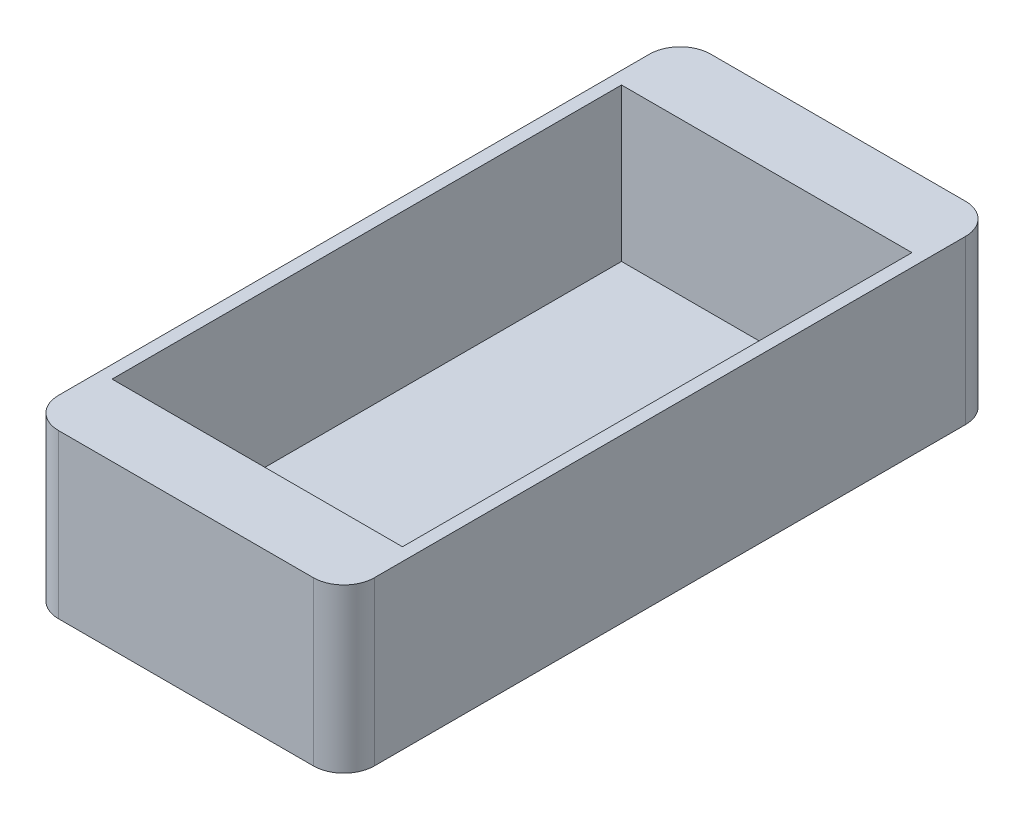
ISO-10303-21;
HEADER;
FILE_DESCRIPTION(('STEP AP214'),'2;1');
FILE_NAME('part.step','',(''),(''),'','','');
FILE_SCHEMA(('AUTOMOTIVE_DESIGN { 1 0 10303 214 1 1 1 1 }'));
ENDSEC;
DATA;
#1=APPLICATION_CONTEXT('core data for automotive mechanical design processes');
#2=APPLICATION_PROTOCOL_DEFINITION('international standard','automotive_design',2000,#1);
#3=PRODUCT_CONTEXT('',#1,'mechanical');
#4=PRODUCT('Part','Part','',(#3));
#5=PRODUCT_RELATED_PRODUCT_CATEGORY('part','',(#4));
#6=PRODUCT_DEFINITION_FORMATION('','',#4);
#7=PRODUCT_DEFINITION_CONTEXT('part definition',#1,'design');
#8=PRODUCT_DEFINITION('design','',#6,#7);
#9=PRODUCT_DEFINITION_SHAPE('','',#8);
#10=(LENGTH_UNIT() NAMED_UNIT(*) SI_UNIT(.MILLI.,.METRE.));
#11=(NAMED_UNIT(*) PLANE_ANGLE_UNIT() SI_UNIT($,.RADIAN.));
#12=(NAMED_UNIT(*) SI_UNIT($,.STERADIAN.) SOLID_ANGLE_UNIT());
#13=UNCERTAINTY_MEASURE_WITH_UNIT(LENGTH_MEASURE(1.E-05),#10,'distance_accuracy_value','');
#14=(GEOMETRIC_REPRESENTATION_CONTEXT(3) GLOBAL_UNCERTAINTY_ASSIGNED_CONTEXT((#13)) GLOBAL_UNIT_ASSIGNED_CONTEXT((#10,
#11,#12)) REPRESENTATION_CONTEXT('',''));
#15=CARTESIAN_POINT('',(0.,0.,0.));
#16=DIRECTION('',(0.,0.,1.));
#17=DIRECTION('',(1.,0.,0.));
#18=AXIS2_PLACEMENT_3D('',#15,#16,#17);
#19=CARTESIAN_POINT('',(0.,15.,0.));
#20=DIRECTION('',(0.,1.,0.));
#21=DIRECTION('',(0.,0.,1.));
#22=AXIS2_PLACEMENT_3D('',#19,#20,#21);
#23=PLANE('',#22);
#24=DIRECTION('',(1.,0.,0.));
#25=VECTOR('',#24,1.);
#26=CARTESIAN_POINT('',(-15.5,15.,32.));
#27=LINE('',#26,#25);
#28=CARTESIAN_POINT('',(-12.5,15.,32.));
#29=VERTEX_POINT('',#28);
#30=CARTESIAN_POINT('',(12.5,15.,32.));
#31=VERTEX_POINT('',#30);
#32=EDGE_CURVE('E170',#29,#31,#27,.T.);
#33=ORIENTED_EDGE('',*,*,#32,.T.);
#34=CARTESIAN_POINT('',(12.5,15.,29.));
#35=DIRECTION('',(0.,1.,0.));
#36=DIRECTION('',(0.,0.,1.));
#37=AXIS2_PLACEMENT_3D('',#34,#35,#36);
#38=CIRCLE('',#37,3.);
#39=CARTESIAN_POINT('',(15.5,15.,29.));
#40=VERTEX_POINT('',#39);
#41=EDGE_CURVE('E196',#31,#40,#38,.T.);
#42=ORIENTED_EDGE('',*,*,#41,.T.);
#43=DIRECTION('',(0.,0.,-1.));
#44=VECTOR('',#43,1.);
#45=CARTESIAN_POINT('',(15.5,15.,-32.));
#46=LINE('',#45,#44);
#47=CARTESIAN_POINT('',(15.5,15.,-29.));
#48=VERTEX_POINT('',#47);
#49=EDGE_CURVE('E163',#40,#48,#46,.T.);
#50=ORIENTED_EDGE('',*,*,#49,.T.);
#51=CARTESIAN_POINT('',(12.5,15.,-29.));
#52=DIRECTION('',(0.,1.,0.));
#53=DIRECTION('',(0.,0.,1.));
#54=AXIS2_PLACEMENT_3D('',#51,#52,#53);
#55=CIRCLE('',#54,3.);
#56=CARTESIAN_POINT('',(12.5,15.,-32.));
#57=VERTEX_POINT('',#56);
#58=EDGE_CURVE('E192',#48,#57,#55,.T.);
#59=ORIENTED_EDGE('',*,*,#58,.T.);
#60=DIRECTION('',(-1.,0.,0.));
#61=VECTOR('',#60,1.);
#62=CARTESIAN_POINT('',(-15.5,15.,-32.));
#63=LINE('',#62,#61);
#64=CARTESIAN_POINT('',(-12.5,15.,-32.));
#65=VERTEX_POINT('',#64);
#66=EDGE_CURVE('E166',#57,#65,#63,.T.);
#67=ORIENTED_EDGE('',*,*,#66,.T.);
#68=CARTESIAN_POINT('',(-12.5,15.,-29.));
#69=DIRECTION('',(0.,1.,0.));
#70=DIRECTION('',(0.,0.,1.));
#71=AXIS2_PLACEMENT_3D('',#68,#69,#70);
#72=CIRCLE('',#71,3.);
#73=CARTESIAN_POINT('',(-15.5,15.,-29.));
#74=VERTEX_POINT('',#73);
#75=EDGE_CURVE('E57',#65,#74,#72,.T.);
#76=ORIENTED_EDGE('',*,*,#75,.T.);
#77=DIRECTION('',(0.,0.,1.));
#78=VECTOR('',#77,1.);
#79=CARTESIAN_POINT('',(-15.5,15.,-32.));
#80=LINE('',#79,#78);
#81=CARTESIAN_POINT('',(-15.5,15.,29.));
#82=VERTEX_POINT('',#81);
#83=EDGE_CURVE('E168',#74,#82,#80,.T.);
#84=ORIENTED_EDGE('',*,*,#83,.T.);
#85=CARTESIAN_POINT('',(-12.5,15.,29.));
#86=DIRECTION('',(0.,1.,0.));
#87=DIRECTION('',(0.,0.,1.));
#88=AXIS2_PLACEMENT_3D('',#85,#86,#87);
#89=CIRCLE('',#88,3.);
#90=EDGE_CURVE('E194',#82,#29,#89,.T.);
#91=ORIENTED_EDGE('',*,*,#90,.T.);
#92=EDGE_LOOP('',(#33,#42,#50,#59,#67,#76,#84,#91));
#93=FACE_BOUND('',#92,.T.);
#94=DIRECTION('',(-1.,0.,0.));
#95=VECTOR('',#94,1.);
#96=CARTESIAN_POINT('',(-14.25,15.,-25.));
#97=LINE('',#96,#95);
#98=CARTESIAN_POINT('',(14.25,15.,-25.));
#99=VERTEX_POINT('',#98);
#100=CARTESIAN_POINT('',(-14.25,15.,-25.));
#101=VERTEX_POINT('',#100);
#102=EDGE_CURVE('E154',#99,#101,#97,.T.);
#103=ORIENTED_EDGE('',*,*,#102,.F.);
#104=DIRECTION('',(0.,0.,-1.));
#105=VECTOR('',#104,1.);
#106=CARTESIAN_POINT('',(14.25,15.,-25.));
#107=LINE('',#106,#105);
#108=CARTESIAN_POINT('',(14.25,15.,25.));
#109=VERTEX_POINT('',#108);
#110=EDGE_CURVE('E152',#109,#99,#107,.T.);
#111=ORIENTED_EDGE('',*,*,#110,.F.);
#112=DIRECTION('',(1.,0.,0.));
#113=VECTOR('',#112,1.);
#114=CARTESIAN_POINT('',(-14.25,15.,25.));
#115=LINE('',#114,#113);
#116=CARTESIAN_POINT('',(-14.25,15.,25.));
#117=VERTEX_POINT('',#116);
#118=EDGE_CURVE('E133',#117,#109,#115,.T.);
#119=ORIENTED_EDGE('',*,*,#118,.F.);
#120=DIRECTION('',(0.,0.,1.));
#121=VECTOR('',#120,1.);
#122=CARTESIAN_POINT('',(-14.25,15.,-25.));
#123=LINE('',#122,#121);
#124=EDGE_CURVE('E229',#101,#117,#123,.T.);
#125=ORIENTED_EDGE('',*,*,#124,.F.);
#126=EDGE_LOOP('',(#103,#111,#119,#125));
#127=FACE_BOUND('',#126,.T.);
#128=ADVANCED_FACE('F35',(#93,#127),#23,.T.);
#129=CARTESIAN_POINT('',(15.5,15.,-32.));
#130=DIRECTION('',(-1.,0.,0.));
#131=DIRECTION('',(0.,0.,1.));
#132=AXIS2_PLACEMENT_3D('',#129,#130,#131);
#133=PLANE('',#132);
#134=ORIENTED_EDGE('',*,*,#49,.F.);
#135=DIRECTION('',(0.,-1.,0.));
#136=VECTOR('',#135,1.);
#137=CARTESIAN_POINT('',(15.5,15.,29.));
#138=LINE('',#137,#136);
#139=CARTESIAN_POINT('',(15.5,-1.,29.));
#140=VERTEX_POINT('',#139);
#141=EDGE_CURVE('E175',#40,#140,#138,.T.);
#142=ORIENTED_EDGE('',*,*,#141,.T.);
#143=DIRECTION('',(0.,0.,-1.));
#144=VECTOR('',#143,1.);
#145=CARTESIAN_POINT('',(15.5,-1.,-32.));
#146=LINE('',#145,#144);
#147=CARTESIAN_POINT('',(15.5,-1.,-29.));
#148=VERTEX_POINT('',#147);
#149=EDGE_CURVE('E222',#140,#148,#146,.T.);
#150=ORIENTED_EDGE('',*,*,#149,.T.);
#151=DIRECTION('',(0.,-1.,0.));
#152=VECTOR('',#151,1.);
#153=CARTESIAN_POINT('',(15.5,15.,-29.));
#154=LINE('',#153,#152);
#155=EDGE_CURVE('E173',#148,#48,#154,.F.);
#156=ORIENTED_EDGE('',*,*,#155,.T.);
#157=EDGE_LOOP('',(#134,#142,#150,#156));
#158=FACE_BOUND('',#157,.T.);
#159=ADVANCED_FACE('F240',(#158),#133,.F.);
#160=CARTESIAN_POINT('',(-15.5,15.,-32.));
#161=DIRECTION('',(0.,0.,1.));
#162=DIRECTION('',(1.,0.,0.));
#163=AXIS2_PLACEMENT_3D('',#160,#161,#162);
#164=PLANE('',#163);
#165=ORIENTED_EDGE('',*,*,#66,.F.);
#166=DIRECTION('',(0.,-1.,0.));
#167=VECTOR('',#166,1.);
#168=CARTESIAN_POINT('',(12.5,15.,-32.));
#169=LINE('',#168,#167);
#170=CARTESIAN_POINT('',(12.5,-1.,-32.));
#171=VERTEX_POINT('',#170);
#172=EDGE_CURVE('E11',#57,#171,#169,.T.);
#173=ORIENTED_EDGE('',*,*,#172,.T.);
#174=DIRECTION('',(-1.,0.,0.));
#175=VECTOR('',#174,1.);
#176=CARTESIAN_POINT('',(-15.5,-1.,-32.));
#177=LINE('',#176,#175);
#178=CARTESIAN_POINT('',(-12.5,-1.,-32.));
#179=VERTEX_POINT('',#178);
#180=EDGE_CURVE('E147',#171,#179,#177,.T.);
#181=ORIENTED_EDGE('',*,*,#180,.T.);
#182=DIRECTION('',(0.,-1.,0.));
#183=VECTOR('',#182,1.);
#184=CARTESIAN_POINT('',(-12.5,15.,-32.));
#185=LINE('',#184,#183);
#186=EDGE_CURVE('E43',#179,#65,#185,.F.);
#187=ORIENTED_EDGE('',*,*,#186,.T.);
#188=EDGE_LOOP('',(#165,#173,#181,#187));
#189=FACE_BOUND('',#188,.T.);
#190=ADVANCED_FACE('F205',(#189),#164,.F.);
#191=CARTESIAN_POINT('',(-15.5,15.,-32.));
#192=DIRECTION('',(1.,0.,0.));
#193=DIRECTION('',(0.,0.,-1.));
#194=AXIS2_PLACEMENT_3D('',#191,#192,#193);
#195=PLANE('',#194);
#196=DIRECTION('',(0.,0.,1.));
#197=VECTOR('',#196,1.);
#198=CARTESIAN_POINT('',(-15.5,-1.,-32.));
#199=LINE('',#198,#197);
#200=CARTESIAN_POINT('',(-15.5,-1.,-29.));
#201=VERTEX_POINT('',#200);
#202=CARTESIAN_POINT('',(-15.5,-1.,29.));
#203=VERTEX_POINT('',#202);
#204=EDGE_CURVE('E214',#201,#203,#199,.T.);
#205=ORIENTED_EDGE('',*,*,#204,.T.);
#206=DIRECTION('',(0.,-1.,0.));
#207=VECTOR('',#206,1.);
#208=CARTESIAN_POINT('',(-15.5,15.,29.));
#209=LINE('',#208,#207);
#210=EDGE_CURVE('E50',#203,#82,#209,.F.);
#211=ORIENTED_EDGE('',*,*,#210,.T.);
#212=ORIENTED_EDGE('',*,*,#83,.F.);
#213=DIRECTION('',(0.,-1.,0.));
#214=VECTOR('',#213,1.);
#215=CARTESIAN_POINT('',(-15.5,15.,-29.));
#216=LINE('',#215,#214);
#217=EDGE_CURVE('E198',#74,#201,#216,.T.);
#218=ORIENTED_EDGE('',*,*,#217,.T.);
#219=EDGE_LOOP('',(#205,#211,#212,#218));
#220=FACE_BOUND('',#219,.T.);
#221=ADVANCED_FACE('F213',(#220),#195,.F.);
#222=CARTESIAN_POINT('',(-15.5,15.,32.));
#223=DIRECTION('',(0.,0.,-1.));
#224=DIRECTION('',(-1.,0.,0.));
#225=AXIS2_PLACEMENT_3D('',#222,#223,#224);
#226=PLANE('',#225);
#227=DIRECTION('',(1.,0.,0.));
#228=VECTOR('',#227,1.);
#229=CARTESIAN_POINT('',(-15.5,-1.,32.));
#230=LINE('',#229,#228);
#231=CARTESIAN_POINT('',(-12.5,-1.,32.));
#232=VERTEX_POINT('',#231);
#233=CARTESIAN_POINT('',(12.5,-1.,32.));
#234=VERTEX_POINT('',#233);
#235=EDGE_CURVE('E219',#232,#234,#230,.T.);
#236=ORIENTED_EDGE('',*,*,#235,.T.);
#237=DIRECTION('',(0.,-1.,0.));
#238=VECTOR('',#237,1.);
#239=CARTESIAN_POINT('',(12.5,15.,32.));
#240=LINE('',#239,#238);
#241=EDGE_CURVE('E189',#234,#31,#240,.F.);
#242=ORIENTED_EDGE('',*,*,#241,.T.);
#243=ORIENTED_EDGE('',*,*,#32,.F.);
#244=DIRECTION('',(0.,-1.,0.));
#245=VECTOR('',#244,1.);
#246=CARTESIAN_POINT('',(-12.5,15.,32.));
#247=LINE('',#246,#245);
#248=EDGE_CURVE('E186',#29,#232,#247,.T.);
#249=ORIENTED_EDGE('',*,*,#248,.T.);
#250=EDGE_LOOP('',(#236,#242,#243,#249));
#251=FACE_BOUND('',#250,.T.);
#252=ADVANCED_FACE('F250',(#251),#226,.F.);
#253=CARTESIAN_POINT('',(14.25,15.,-25.));
#254=DIRECTION('',(-1.,0.,0.));
#255=DIRECTION('',(0.,0.,1.));
#256=AXIS2_PLACEMENT_3D('',#253,#254,#255);
#257=PLANE('',#256);
#258=DIRECTION('',(0.,0.,-1.));
#259=VECTOR('',#258,1.);
#260=CARTESIAN_POINT('',(14.25,0.,-25.));
#261=LINE('',#260,#259);
#262=CARTESIAN_POINT('',(14.25,0.,25.));
#263=VERTEX_POINT('',#262);
#264=CARTESIAN_POINT('',(14.25,0.,-25.));
#265=VERTEX_POINT('',#264);
#266=EDGE_CURVE('E140',#263,#265,#261,.T.);
#267=ORIENTED_EDGE('',*,*,#266,.F.);
#268=DIRECTION('',(0.,-1.,0.));
#269=VECTOR('',#268,1.);
#270=CARTESIAN_POINT('',(14.25,15.,25.));
#271=LINE('',#270,#269);
#272=EDGE_CURVE('E126',#109,#263,#271,.T.);
#273=ORIENTED_EDGE('',*,*,#272,.F.);
#274=ORIENTED_EDGE('',*,*,#110,.T.);
#275=DIRECTION('',(0.,-1.,0.));
#276=VECTOR('',#275,1.);
#277=CARTESIAN_POINT('',(14.25,15.,-25.));
#278=LINE('',#277,#276);
#279=EDGE_CURVE('E143',#99,#265,#278,.T.);
#280=ORIENTED_EDGE('',*,*,#279,.T.);
#281=EDGE_LOOP('',(#267,#273,#274,#280));
#282=FACE_BOUND('',#281,.T.);
#283=ADVANCED_FACE('F141',(#282),#257,.T.);
#284=CARTESIAN_POINT('',(-14.25,15.,-25.));
#285=DIRECTION('',(0.,0.,1.));
#286=DIRECTION('',(1.,0.,0.));
#287=AXIS2_PLACEMENT_3D('',#284,#285,#286);
#288=PLANE('',#287);
#289=DIRECTION('',(-1.,0.,0.));
#290=VECTOR('',#289,1.);
#291=CARTESIAN_POINT('',(-14.25,0.,-25.));
#292=LINE('',#291,#290);
#293=CARTESIAN_POINT('',(-14.25,0.,-25.));
#294=VERTEX_POINT('',#293);
#295=EDGE_CURVE('E146',#265,#294,#292,.T.);
#296=ORIENTED_EDGE('',*,*,#295,.F.);
#297=ORIENTED_EDGE('',*,*,#279,.F.);
#298=ORIENTED_EDGE('',*,*,#102,.T.);
#299=DIRECTION('',(0.,-1.,0.));
#300=VECTOR('',#299,1.);
#301=CARTESIAN_POINT('',(-14.25,15.,-25.));
#302=LINE('',#301,#300);
#303=EDGE_CURVE('E160',#101,#294,#302,.T.);
#304=ORIENTED_EDGE('',*,*,#303,.T.);
#305=EDGE_LOOP('',(#296,#297,#298,#304));
#306=FACE_BOUND('',#305,.T.);
#307=ADVANCED_FACE('F233',(#306),#288,.T.);
#308=CARTESIAN_POINT('',(-14.25,15.,-25.));
#309=DIRECTION('',(1.,0.,0.));
#310=DIRECTION('',(0.,0.,-1.));
#311=AXIS2_PLACEMENT_3D('',#308,#309,#310);
#312=PLANE('',#311);
#313=DIRECTION('',(0.,0.,1.));
#314=VECTOR('',#313,1.);
#315=CARTESIAN_POINT('',(-14.25,0.,-25.));
#316=LINE('',#315,#314);
#317=CARTESIAN_POINT('',(-14.25,0.,25.));
#318=VERTEX_POINT('',#317);
#319=EDGE_CURVE('E151',#294,#318,#316,.T.);
#320=ORIENTED_EDGE('',*,*,#319,.F.);
#321=ORIENTED_EDGE('',*,*,#303,.F.);
#322=ORIENTED_EDGE('',*,*,#124,.T.);
#323=DIRECTION('',(0.,-1.,0.));
#324=VECTOR('',#323,1.);
#325=CARTESIAN_POINT('',(-14.25,15.,25.));
#326=LINE('',#325,#324);
#327=EDGE_CURVE('E136',#117,#318,#326,.T.);
#328=ORIENTED_EDGE('',*,*,#327,.T.);
#329=EDGE_LOOP('',(#320,#321,#322,#328));
#330=FACE_BOUND('',#329,.T.);
#331=ADVANCED_FACE('F238',(#330),#312,.T.);
#332=CARTESIAN_POINT('',(-14.25,15.,25.));
#333=DIRECTION('',(0.,0.,-1.));
#334=DIRECTION('',(-1.,0.,0.));
#335=AXIS2_PLACEMENT_3D('',#332,#333,#334);
#336=PLANE('',#335);
#337=DIRECTION('',(1.,0.,0.));
#338=VECTOR('',#337,1.);
#339=CARTESIAN_POINT('',(-14.25,0.,25.));
#340=LINE('',#339,#338);
#341=EDGE_CURVE('E130',#318,#263,#340,.T.);
#342=ORIENTED_EDGE('',*,*,#341,.F.);
#343=ORIENTED_EDGE('',*,*,#327,.F.);
#344=ORIENTED_EDGE('',*,*,#118,.T.);
#345=ORIENTED_EDGE('',*,*,#272,.T.);
#346=EDGE_LOOP('',(#342,#343,#344,#345));
#347=FACE_BOUND('',#346,.T.);
#348=ADVANCED_FACE('F128',(#347),#336,.T.);
#349=CARTESIAN_POINT('',(0.,0.,0.));
#350=DIRECTION('',(0.,1.,0.));
#351=DIRECTION('',(0.,0.,1.));
#352=AXIS2_PLACEMENT_3D('',#349,#350,#351);
#353=PLANE('',#352);
#354=ORIENTED_EDGE('',*,*,#341,.T.);
#355=ORIENTED_EDGE('',*,*,#266,.T.);
#356=ORIENTED_EDGE('',*,*,#295,.T.);
#357=ORIENTED_EDGE('',*,*,#319,.T.);
#358=EDGE_LOOP('',(#354,#355,#356,#357));
#359=FACE_BOUND('',#358,.T.);
#360=ADVANCED_FACE('F149',(#359),#353,.T.);
#361=CARTESIAN_POINT('',(0.,-1.,0.));
#362=DIRECTION('',(0.,1.,0.));
#363=DIRECTION('',(0.,0.,1.));
#364=AXIS2_PLACEMENT_3D('',#361,#362,#363);
#365=PLANE('',#364);
#366=ORIENTED_EDGE('',*,*,#149,.F.);
#367=CARTESIAN_POINT('',(12.5,-1.,29.));
#368=DIRECTION('',(0.,1.,0.));
#369=DIRECTION('',(0.,0.,1.));
#370=AXIS2_PLACEMENT_3D('',#367,#368,#369);
#371=CIRCLE('',#370,3.);
#372=EDGE_CURVE('E184',#140,#234,#371,.F.);
#373=ORIENTED_EDGE('',*,*,#372,.T.);
#374=ORIENTED_EDGE('',*,*,#235,.F.);
#375=CARTESIAN_POINT('',(-12.5,-1.,29.));
#376=DIRECTION('',(0.,1.,0.));
#377=DIRECTION('',(0.,0.,1.));
#378=AXIS2_PLACEMENT_3D('',#375,#376,#377);
#379=CIRCLE('',#378,3.);
#380=EDGE_CURVE('E182',#232,#203,#379,.F.);
#381=ORIENTED_EDGE('',*,*,#380,.T.);
#382=ORIENTED_EDGE('',*,*,#204,.F.);
#383=CARTESIAN_POINT('',(-12.5,-1.,-29.));
#384=DIRECTION('',(0.,1.,0.));
#385=DIRECTION('',(0.,0.,1.));
#386=AXIS2_PLACEMENT_3D('',#383,#384,#385);
#387=CIRCLE('',#386,3.);
#388=EDGE_CURVE('E178',#201,#179,#387,.F.);
#389=ORIENTED_EDGE('',*,*,#388,.T.);
#390=ORIENTED_EDGE('',*,*,#180,.F.);
#391=CARTESIAN_POINT('',(12.5,-1.,-29.));
#392=DIRECTION('',(0.,1.,0.));
#393=DIRECTION('',(0.,0.,1.));
#394=AXIS2_PLACEMENT_3D('',#391,#392,#393);
#395=CIRCLE('',#394,3.);
#396=EDGE_CURVE('E180',#171,#148,#395,.F.);
#397=ORIENTED_EDGE('',*,*,#396,.T.);
#398=EDGE_LOOP('',(#366,#373,#374,#381,#382,#389,#390,#397));
#399=FACE_BOUND('',#398,.T.);
#400=ADVANCED_FACE('F217',(#399),#365,.F.);
#401=CARTESIAN_POINT('',(12.5,15.,29.));
#402=DIRECTION('',(0.,-1.,0.));
#403=DIRECTION('',(0.,0.,-1.));
#404=AXIS2_PLACEMENT_3D('',#401,#402,#403);
#405=CYLINDRICAL_SURFACE('',#404,3.);
#406=ORIENTED_EDGE('',*,*,#41,.F.);
#407=ORIENTED_EDGE('',*,*,#241,.F.);
#408=ORIENTED_EDGE('',*,*,#372,.F.);
#409=ORIENTED_EDGE('',*,*,#141,.F.);
#410=EDGE_LOOP('',(#406,#407,#408,#409));
#411=FACE_BOUND('',#410,.T.);
#412=ADVANCED_FACE('F258',(#411),#405,.T.);
#413=CARTESIAN_POINT('',(-12.5,15.,29.));
#414=DIRECTION('',(0.,-1.,0.));
#415=DIRECTION('',(0.,0.,-1.));
#416=AXIS2_PLACEMENT_3D('',#413,#414,#415);
#417=CYLINDRICAL_SURFACE('',#416,3.);
#418=ORIENTED_EDGE('',*,*,#90,.F.);
#419=ORIENTED_EDGE('',*,*,#210,.F.);
#420=ORIENTED_EDGE('',*,*,#380,.F.);
#421=ORIENTED_EDGE('',*,*,#248,.F.);
#422=EDGE_LOOP('',(#418,#419,#420,#421));
#423=FACE_BOUND('',#422,.T.);
#424=ADVANCED_FACE('F261',(#423),#417,.T.);
#425=CARTESIAN_POINT('',(12.5,15.,-29.));
#426=DIRECTION('',(0.,-1.,0.));
#427=DIRECTION('',(0.,0.,-1.));
#428=AXIS2_PLACEMENT_3D('',#425,#426,#427);
#429=CYLINDRICAL_SURFACE('',#428,3.);
#430=ORIENTED_EDGE('',*,*,#58,.F.);
#431=ORIENTED_EDGE('',*,*,#155,.F.);
#432=ORIENTED_EDGE('',*,*,#396,.F.);
#433=ORIENTED_EDGE('',*,*,#172,.F.);
#434=EDGE_LOOP('',(#430,#431,#432,#433));
#435=FACE_BOUND('',#434,.T.);
#436=ADVANCED_FACE('F264',(#435),#429,.T.);
#437=CARTESIAN_POINT('',(-12.5,15.,-29.));
#438=DIRECTION('',(0.,-1.,0.));
#439=DIRECTION('',(0.,0.,-1.));
#440=AXIS2_PLACEMENT_3D('',#437,#438,#439);
#441=CYLINDRICAL_SURFACE('',#440,3.);
#442=ORIENTED_EDGE('',*,*,#75,.F.);
#443=ORIENTED_EDGE('',*,*,#186,.F.);
#444=ORIENTED_EDGE('',*,*,#388,.F.);
#445=ORIENTED_EDGE('',*,*,#217,.F.);
#446=EDGE_LOOP('',(#442,#443,#444,#445));
#447=FACE_BOUND('',#446,.T.);
#448=ADVANCED_FACE('F37',(#447),#441,.T.);
#449=CLOSED_SHELL('',(#128,#159,#190,#221,#252,#283,#307,#331,#348,#360,#400,#412,#424,#436,#448));
#450=MANIFOLD_SOLID_BREP('B2',#449);
#451=ADVANCED_BREP_SHAPE_REPRESENTATION('',(#18,#450),#14);
#452=SHAPE_DEFINITION_REPRESENTATION(#9,#451);
ENDSEC;
END-ISO-10303-21;
